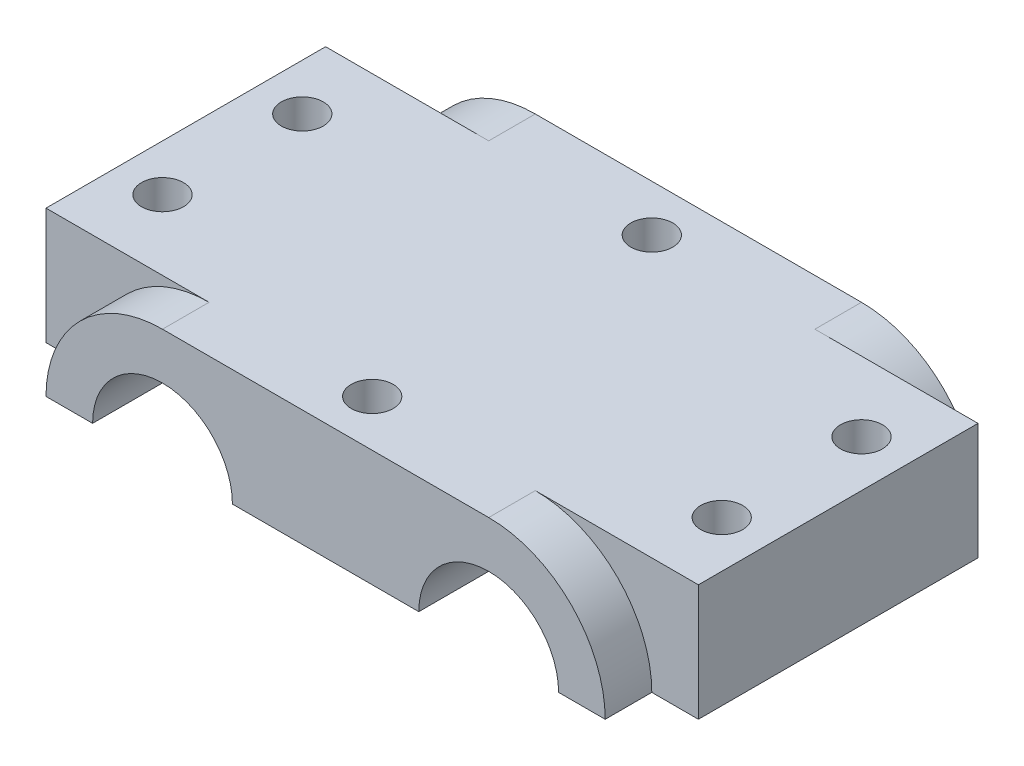
ISO-10303-21;
HEADER;
FILE_DESCRIPTION(('STEP AP214'),'2;1');
FILE_NAME('part.step','',(''),(''),'','','');
FILE_SCHEMA(('AUTOMOTIVE_DESIGN { 1 0 10303 214 1 1 1 1 }'));
ENDSEC;
DATA;
#1=APPLICATION_CONTEXT('core data for automotive mechanical design processes');
#2=APPLICATION_PROTOCOL_DEFINITION('international standard','automotive_design',2000,#1);
#3=PRODUCT_CONTEXT('',#1,'mechanical');
#4=PRODUCT('Part','Part','',(#3));
#5=PRODUCT_RELATED_PRODUCT_CATEGORY('part','',(#4));
#6=PRODUCT_DEFINITION_FORMATION('','',#4);
#7=PRODUCT_DEFINITION_CONTEXT('part definition',#1,'design');
#8=PRODUCT_DEFINITION('design','',#6,#7);
#9=PRODUCT_DEFINITION_SHAPE('','',#8);
#10=(LENGTH_UNIT() NAMED_UNIT(*) SI_UNIT(.MILLI.,.METRE.));
#11=(NAMED_UNIT(*) PLANE_ANGLE_UNIT() SI_UNIT($,.RADIAN.));
#12=(NAMED_UNIT(*) SI_UNIT($,.STERADIAN.) SOLID_ANGLE_UNIT());
#13=UNCERTAINTY_MEASURE_WITH_UNIT(LENGTH_MEASURE(1.E-05),#10,'distance_accuracy_value','');
#14=(GEOMETRIC_REPRESENTATION_CONTEXT(3) GLOBAL_UNCERTAINTY_ASSIGNED_CONTEXT((#13)) GLOBAL_UNIT_ASSIGNED_CONTEXT((#10,
#11,#12)) REPRESENTATION_CONTEXT('',''));
#15=CARTESIAN_POINT('',(0.,0.,0.));
#16=DIRECTION('',(0.,0.,1.));
#17=DIRECTION('',(1.,0.,0.));
#18=AXIS2_PLACEMENT_3D('',#15,#16,#17);
#19=CARTESIAN_POINT('',(70.,0.,40.));
#20=DIRECTION('',(-1.,0.,0.));
#21=DIRECTION('',(0.,0.,1.));
#22=AXIS2_PLACEMENT_3D('',#19,#20,#21);
#23=PLANE('',#22);
#24=DIRECTION('',(0.,1.,0.));
#25=VECTOR('',#24,1.);
#26=CARTESIAN_POINT('',(70.,0.,5.));
#27=LINE('',#26,#25);
#28=CARTESIAN_POINT('',(70.,0.,5.));
#29=VERTEX_POINT('',#28);
#30=CARTESIAN_POINT('',(70.,12.5,5.));
#31=VERTEX_POINT('',#30);
#32=EDGE_CURVE('E181',#29,#31,#27,.T.);
#33=ORIENTED_EDGE('',*,*,#32,.T.);
#34=DIRECTION('',(0.,0.,-1.));
#35=VECTOR('',#34,1.);
#36=CARTESIAN_POINT('',(70.,12.5,40.));
#37=LINE('',#36,#35);
#38=CARTESIAN_POINT('',(70.,12.5,35.));
#39=VERTEX_POINT('',#38);
#40=EDGE_CURVE('E255',#39,#31,#37,.T.);
#41=ORIENTED_EDGE('',*,*,#40,.F.);
#42=DIRECTION('',(0.,1.,0.));
#43=VECTOR('',#42,1.);
#44=CARTESIAN_POINT('',(70.,0.,35.));
#45=LINE('',#44,#43);
#46=CARTESIAN_POINT('',(70.,0.,35.));
#47=VERTEX_POINT('',#46);
#48=EDGE_CURVE('E215',#47,#39,#45,.T.);
#49=ORIENTED_EDGE('',*,*,#48,.F.);
#50=DIRECTION('',(0.,0.,-1.));
#51=VECTOR('',#50,1.);
#52=CARTESIAN_POINT('',(70.,0.,40.));
#53=LINE('',#52,#51);
#54=EDGE_CURVE('E258',#47,#29,#53,.T.);
#55=ORIENTED_EDGE('',*,*,#54,.T.);
#56=EDGE_LOOP('',(#33,#41,#49,#55));
#57=FACE_BOUND('',#56,.T.);
#58=ADVANCED_FACE('F37',(#57),#23,.F.);
#59=CARTESIAN_POINT('',(0.,12.5,40.));
#60=DIRECTION('',(0.,-1.,0.));
#61=DIRECTION('',(0.,0.,-1.));
#62=AXIS2_PLACEMENT_3D('',#59,#60,#61);
#63=PLANE('',#62);
#64=CARTESIAN_POINT('',(35.,12.5,5.));
#65=DIRECTION('',(0.,1.,0.));
#66=DIRECTION('',(0.,0.,1.));
#67=AXIS2_PLACEMENT_3D('',#64,#65,#66);
#68=CIRCLE('',#67,2.25);
#69=CARTESIAN_POINT('',(35.,12.5,7.25));
#70=VERTEX_POINT('',#69);
#71=EDGE_CURVE('E388',#70,#70,#68,.T.);
#72=ORIENTED_EDGE('',*,*,#71,.F.);
#73=EDGE_LOOP('',(#72));
#74=FACE_BOUND('',#73,.T.);
#75=CARTESIAN_POINT('',(65.,12.5,27.5));
#76=DIRECTION('',(0.,1.,0.));
#77=DIRECTION('',(0.,0.,1.));
#78=AXIS2_PLACEMENT_3D('',#75,#76,#77);
#79=CIRCLE('',#78,2.24999999999998);
#80=CARTESIAN_POINT('',(65.,12.5,29.75));
#81=VERTEX_POINT('',#80);
#82=EDGE_CURVE('E376',#81,#81,#79,.T.);
#83=ORIENTED_EDGE('',*,*,#82,.F.);
#84=EDGE_LOOP('',(#83));
#85=FACE_BOUND('',#84,.T.);
#86=CARTESIAN_POINT('',(35.,12.5,35.));
#87=DIRECTION('',(0.,1.,0.));
#88=DIRECTION('',(0.,0.,1.));
#89=AXIS2_PLACEMENT_3D('',#86,#87,#88);
#90=CIRCLE('',#89,2.25);
#91=CARTESIAN_POINT('',(35.,12.5,37.25));
#92=VERTEX_POINT('',#91);
#93=EDGE_CURVE('E384',#92,#92,#90,.T.);
#94=ORIENTED_EDGE('',*,*,#93,.F.);
#95=EDGE_LOOP('',(#94));
#96=FACE_BOUND('',#95,.T.);
#97=CARTESIAN_POINT('',(5.,12.5,12.5));
#98=DIRECTION('',(0.,1.,0.));
#99=DIRECTION('',(0.,0.,1.));
#100=AXIS2_PLACEMENT_3D('',#97,#98,#99);
#101=CIRCLE('',#100,2.25);
#102=CARTESIAN_POINT('',(5.,12.5,14.75));
#103=VERTEX_POINT('',#102);
#104=EDGE_CURVE('E385',#103,#103,#101,.T.);
#105=ORIENTED_EDGE('',*,*,#104,.F.);
#106=EDGE_LOOP('',(#105));
#107=FACE_BOUND('',#106,.T.);
#108=CARTESIAN_POINT('',(5.,12.5,27.5));
#109=DIRECTION('',(0.,1.,0.));
#110=DIRECTION('',(0.,0.,1.));
#111=AXIS2_PLACEMENT_3D('',#108,#109,#110);
#112=CIRCLE('',#111,2.25);
#113=CARTESIAN_POINT('',(5.,12.5,29.75));
#114=VERTEX_POINT('',#113);
#115=EDGE_CURVE('E367',#114,#114,#112,.T.);
#116=ORIENTED_EDGE('',*,*,#115,.F.);
#117=EDGE_LOOP('',(#116));
#118=FACE_BOUND('',#117,.T.);
#119=CARTESIAN_POINT('',(65.,12.5,12.5));
#120=DIRECTION('',(0.,1.,0.));
#121=DIRECTION('',(0.,0.,1.));
#122=AXIS2_PLACEMENT_3D('',#119,#120,#121);
#123=CIRCLE('',#122,2.24999999999998);
#124=CARTESIAN_POINT('',(65.,12.5,14.75));
#125=VERTEX_POINT('',#124);
#126=EDGE_CURVE('E368',#125,#125,#123,.T.);
#127=ORIENTED_EDGE('',*,*,#126,.F.);
#128=EDGE_LOOP('',(#127));
#129=FACE_BOUND('',#128,.T.);
#130=DIRECTION('',(0.,0.,-1.));
#131=VECTOR('',#130,1.);
#132=CARTESIAN_POINT('',(17.5,12.5,5.));
#133=LINE('',#132,#131);
#134=CARTESIAN_POINT('',(17.5,12.5,5.));
#135=VERTEX_POINT('',#134);
#136=CARTESIAN_POINT('',(17.5,12.5,0.));
#137=VERTEX_POINT('',#136);
#138=EDGE_CURVE('E60',#135,#137,#133,.T.);
#139=ORIENTED_EDGE('',*,*,#138,.F.);
#140=DIRECTION('',(-1.,0.,0.));
#141=VECTOR('',#140,1.);
#142=CARTESIAN_POINT('',(17.5,12.5,5.));
#143=LINE('',#142,#141);
#144=CARTESIAN_POINT('',(0.,12.5,5.));
#145=VERTEX_POINT('',#144);
#146=EDGE_CURVE('E156',#135,#145,#143,.T.);
#147=ORIENTED_EDGE('',*,*,#146,.T.);
#148=DIRECTION('',(0.,0.,-1.));
#149=VECTOR('',#148,1.);
#150=CARTESIAN_POINT('',(0.,12.5,40.));
#151=LINE('',#150,#149);
#152=CARTESIAN_POINT('',(0.,12.5,35.));
#153=VERTEX_POINT('',#152);
#154=EDGE_CURVE('E242',#153,#145,#151,.T.);
#155=ORIENTED_EDGE('',*,*,#154,.F.);
#156=DIRECTION('',(-1.,0.,0.));
#157=VECTOR('',#156,1.);
#158=CARTESIAN_POINT('',(17.5,12.5,35.));
#159=LINE('',#158,#157);
#160=CARTESIAN_POINT('',(17.5,12.5,35.));
#161=VERTEX_POINT('',#160);
#162=EDGE_CURVE('E195',#161,#153,#159,.T.);
#163=ORIENTED_EDGE('',*,*,#162,.F.);
#164=DIRECTION('',(0.,0.,1.));
#165=VECTOR('',#164,1.);
#166=CARTESIAN_POINT('',(17.5,12.5,35.));
#167=LINE('',#166,#165);
#168=CARTESIAN_POINT('',(17.5,12.5,40.));
#169=VERTEX_POINT('',#168);
#170=EDGE_CURVE('E208',#161,#169,#167,.T.);
#171=ORIENTED_EDGE('',*,*,#170,.T.);
#172=DIRECTION('',(-1.,0.,0.));
#173=VECTOR('',#172,1.);
#174=CARTESIAN_POINT('',(0.,12.5,40.));
#175=LINE('',#174,#173);
#176=CARTESIAN_POINT('',(52.5,12.5,40.));
#177=VERTEX_POINT('',#176);
#178=EDGE_CURVE('E239',#177,#169,#175,.T.);
#179=ORIENTED_EDGE('',*,*,#178,.F.);
#180=DIRECTION('',(0.,0.,1.));
#181=VECTOR('',#180,1.);
#182=CARTESIAN_POINT('',(52.5,12.5,35.));
#183=LINE('',#182,#181);
#184=CARTESIAN_POINT('',(52.5,12.5,35.));
#185=VERTEX_POINT('',#184);
#186=EDGE_CURVE('E213',#185,#177,#183,.T.);
#187=ORIENTED_EDGE('',*,*,#186,.F.);
#188=DIRECTION('',(-1.,0.,0.));
#189=VECTOR('',#188,1.);
#190=CARTESIAN_POINT('',(70.,12.5,35.));
#191=LINE('',#190,#189);
#192=EDGE_CURVE('E219',#39,#185,#191,.T.);
#193=ORIENTED_EDGE('',*,*,#192,.F.);
#194=ORIENTED_EDGE('',*,*,#40,.T.);
#195=DIRECTION('',(-1.,0.,0.));
#196=VECTOR('',#195,1.);
#197=CARTESIAN_POINT('',(70.,12.5,5.));
#198=LINE('',#197,#196);
#199=CARTESIAN_POINT('',(52.5,12.5,5.));
#200=VERTEX_POINT('',#199);
#201=EDGE_CURVE('E178',#31,#200,#198,.T.);
#202=ORIENTED_EDGE('',*,*,#201,.T.);
#203=DIRECTION('',(0.,0.,-1.));
#204=VECTOR('',#203,1.);
#205=CARTESIAN_POINT('',(52.5,12.5,5.));
#206=LINE('',#205,#204);
#207=CARTESIAN_POINT('',(52.5,12.5,0.));
#208=VERTEX_POINT('',#207);
#209=EDGE_CURVE('E192',#200,#208,#206,.T.);
#210=ORIENTED_EDGE('',*,*,#209,.T.);
#211=DIRECTION('',(-1.,0.,0.));
#212=VECTOR('',#211,1.);
#213=CARTESIAN_POINT('',(0.,12.5,0.));
#214=LINE('',#213,#212);
#215=EDGE_CURVE('E171',#208,#137,#214,.T.);
#216=ORIENTED_EDGE('',*,*,#215,.T.);
#217=EDGE_LOOP('',(#139,#147,#155,#163,#171,#179,#187,#193,#194,#202,#210,#216));
#218=FACE_BOUND('',#217,.T.);
#219=ADVANCED_FACE('F168',(#74,#85,#96,#107,#118,#129,#218),#63,.F.);
#220=CARTESIAN_POINT('',(0.,0.,40.));
#221=DIRECTION('',(0.,1.,0.));
#222=DIRECTION('',(0.,0.,1.));
#223=AXIS2_PLACEMENT_3D('',#220,#221,#222);
#224=PLANE('',#223);
#225=CARTESIAN_POINT('',(5.,0.,12.5));
#226=DIRECTION('',(0.,1.,0.));
#227=DIRECTION('',(0.,0.,1.));
#228=AXIS2_PLACEMENT_3D('',#225,#226,#227);
#229=CIRCLE('',#228,2.25);
#230=CARTESIAN_POINT('',(5.,0.,14.75));
#231=VERTEX_POINT('',#230);
#232=EDGE_CURVE('E362',#231,#231,#229,.F.);
#233=ORIENTED_EDGE('',*,*,#232,.F.);
#234=EDGE_LOOP('',(#233));
#235=FACE_BOUND('',#234,.T.);
#236=CARTESIAN_POINT('',(5.,0.,27.5));
#237=DIRECTION('',(0.,1.,0.));
#238=DIRECTION('',(0.,0.,1.));
#239=AXIS2_PLACEMENT_3D('',#236,#237,#238);
#240=CIRCLE('',#239,2.25);
#241=CARTESIAN_POINT('',(5.,0.,29.75));
#242=VERTEX_POINT('',#241);
#243=EDGE_CURVE('E365',#242,#242,#240,.F.);
#244=ORIENTED_EDGE('',*,*,#243,.F.);
#245=EDGE_LOOP('',(#244));
#246=FACE_BOUND('',#245,.T.);
#247=DIRECTION('',(0.,0.,-1.));
#248=VECTOR('',#247,1.);
#249=CARTESIAN_POINT('',(5.00000000000001,0.,5.));
#250=LINE('',#249,#248);
#251=CARTESIAN_POINT('',(5.00000000000001,0.,5.));
#252=VERTEX_POINT('',#251);
#253=CARTESIAN_POINT('',(5.00000000000001,0.,0.));
#254=VERTEX_POINT('',#253);
#255=EDGE_CURVE('E152',#252,#254,#250,.T.);
#256=ORIENTED_EDGE('',*,*,#255,.T.);
#257=DIRECTION('',(1.,0.,0.));
#258=VECTOR('',#257,1.);
#259=CARTESIAN_POINT('',(0.,0.,0.));
#260=LINE('',#259,#258);
#261=CARTESIAN_POINT('',(9.99999999999999,0.,0.));
#262=VERTEX_POINT('',#261);
#263=EDGE_CURVE('E211',#254,#262,#260,.T.);
#264=ORIENTED_EDGE('',*,*,#263,.T.);
#265=DIRECTION('',(0.,0.,-1.));
#266=VECTOR('',#265,1.);
#267=CARTESIAN_POINT('',(9.99999999999999,0.,40.));
#268=LINE('',#267,#266);
#269=CARTESIAN_POINT('',(9.99999999999999,0.,40.));
#270=VERTEX_POINT('',#269);
#271=EDGE_CURVE('E45',#270,#262,#268,.T.);
#272=ORIENTED_EDGE('',*,*,#271,.F.);
#273=DIRECTION('',(1.,0.,0.));
#274=VECTOR('',#273,1.);
#275=CARTESIAN_POINT('',(0.,0.,40.));
#276=LINE('',#275,#274);
#277=CARTESIAN_POINT('',(5.,0.,40.));
#278=VERTEX_POINT('',#277);
#279=EDGE_CURVE('E228',#278,#270,#276,.T.);
#280=ORIENTED_EDGE('',*,*,#279,.F.);
#281=DIRECTION('',(0.,0.,1.));
#282=VECTOR('',#281,1.);
#283=CARTESIAN_POINT('',(5.00000000000001,0.,35.));
#284=LINE('',#283,#282);
#285=CARTESIAN_POINT('',(5.00000000000001,0.,35.));
#286=VERTEX_POINT('',#285);
#287=EDGE_CURVE('E205',#286,#278,#284,.T.);
#288=ORIENTED_EDGE('',*,*,#287,.F.);
#289=DIRECTION('',(1.,0.,0.));
#290=VECTOR('',#289,1.);
#291=CARTESIAN_POINT('',(0.,0.,35.));
#292=LINE('',#291,#290);
#293=CARTESIAN_POINT('',(0.,0.,35.));
#294=VERTEX_POINT('',#293);
#295=EDGE_CURVE('E200',#294,#286,#292,.T.);
#296=ORIENTED_EDGE('',*,*,#295,.F.);
#297=DIRECTION('',(0.,0.,-1.));
#298=VECTOR('',#297,1.);
#299=CARTESIAN_POINT('',(0.,0.,40.));
#300=LINE('',#299,#298);
#301=CARTESIAN_POINT('',(0.,0.,5.));
#302=VERTEX_POINT('',#301);
#303=EDGE_CURVE('E11',#294,#302,#300,.T.);
#304=ORIENTED_EDGE('',*,*,#303,.T.);
#305=DIRECTION('',(1.,0.,0.));
#306=VECTOR('',#305,1.);
#307=CARTESIAN_POINT('',(0.,0.,5.));
#308=LINE('',#307,#306);
#309=EDGE_CURVE('E155',#302,#252,#308,.T.);
#310=ORIENTED_EDGE('',*,*,#309,.T.);
#311=EDGE_LOOP('',(#256,#264,#272,#280,#288,#296,#304,#310));
#312=FACE_BOUND('',#311,.T.);
#313=ADVANCED_FACE('F298',(#235,#246,#312),#224,.F.);
#314=CARTESIAN_POINT('',(60.,0.,40.));
#315=DIRECTION('',(0.,1.,0.));
#316=DIRECTION('',(0.,0.,1.));
#317=AXIS2_PLACEMENT_3D('',#314,#315,#316);
#318=PLANE('',#317);
#319=CARTESIAN_POINT('',(65.,0.,27.5));
#320=DIRECTION('',(0.,1.,0.));
#321=DIRECTION('',(0.,0.,1.));
#322=AXIS2_PLACEMENT_3D('',#319,#320,#321);
#323=CIRCLE('',#322,2.24999999999998);
#324=CARTESIAN_POINT('',(65.,0.,29.75));
#325=VERTEX_POINT('',#324);
#326=EDGE_CURVE('E637',#325,#325,#323,.F.);
#327=ORIENTED_EDGE('',*,*,#326,.F.);
#328=EDGE_LOOP('',(#327));
#329=FACE_BOUND('',#328,.T.);
#330=CARTESIAN_POINT('',(65.,0.,12.5));
#331=DIRECTION('',(0.,1.,0.));
#332=DIRECTION('',(0.,0.,1.));
#333=AXIS2_PLACEMENT_3D('',#330,#331,#332);
#334=CIRCLE('',#333,2.24999999999998);
#335=CARTESIAN_POINT('',(65.,0.,14.75));
#336=VERTEX_POINT('',#335);
#337=EDGE_CURVE('E373',#336,#336,#334,.F.);
#338=ORIENTED_EDGE('',*,*,#337,.F.);
#339=EDGE_LOOP('',(#338));
#340=FACE_BOUND('',#339,.T.);
#341=DIRECTION('',(0.,0.,-1.));
#342=VECTOR('',#341,1.);
#343=CARTESIAN_POINT('',(65.,0.,5.));
#344=LINE('',#343,#342);
#345=CARTESIAN_POINT('',(65.,0.,5.));
#346=VERTEX_POINT('',#345);
#347=CARTESIAN_POINT('',(65.,0.,0.));
#348=VERTEX_POINT('',#347);
#349=EDGE_CURVE('E52',#346,#348,#344,.T.);
#350=ORIENTED_EDGE('',*,*,#349,.F.);
#351=DIRECTION('',(1.,0.,0.));
#352=VECTOR('',#351,1.);
#353=CARTESIAN_POINT('',(65.,0.,5.));
#354=LINE('',#353,#352);
#355=EDGE_CURVE('E185',#346,#29,#354,.T.);
#356=ORIENTED_EDGE('',*,*,#355,.T.);
#357=ORIENTED_EDGE('',*,*,#54,.F.);
#358=DIRECTION('',(1.,0.,0.));
#359=VECTOR('',#358,1.);
#360=CARTESIAN_POINT('',(65.,0.,35.));
#361=LINE('',#360,#359);
#362=CARTESIAN_POINT('',(65.,0.,35.));
#363=VERTEX_POINT('',#362);
#364=EDGE_CURVE('E221',#363,#47,#361,.T.);
#365=ORIENTED_EDGE('',*,*,#364,.F.);
#366=DIRECTION('',(0.,0.,1.));
#367=VECTOR('',#366,1.);
#368=CARTESIAN_POINT('',(65.,0.,35.));
#369=LINE('',#368,#367);
#370=CARTESIAN_POINT('',(65.,0.,40.));
#371=VERTEX_POINT('',#370);
#372=EDGE_CURVE('E173',#363,#371,#369,.T.);
#373=ORIENTED_EDGE('',*,*,#372,.T.);
#374=DIRECTION('',(1.,0.,0.));
#375=VECTOR('',#374,1.);
#376=CARTESIAN_POINT('',(60.,0.,40.));
#377=LINE('',#376,#375);
#378=CARTESIAN_POINT('',(60.,0.,40.));
#379=VERTEX_POINT('',#378);
#380=EDGE_CURVE('E236',#379,#371,#377,.T.);
#381=ORIENTED_EDGE('',*,*,#380,.F.);
#382=DIRECTION('',(0.,0.,-1.));
#383=VECTOR('',#382,1.);
#384=CARTESIAN_POINT('',(60.,0.,40.));
#385=LINE('',#384,#383);
#386=CARTESIAN_POINT('',(60.,0.,0.));
#387=VERTEX_POINT('',#386);
#388=EDGE_CURVE('E261',#379,#387,#385,.T.);
#389=ORIENTED_EDGE('',*,*,#388,.T.);
#390=DIRECTION('',(1.,0.,0.));
#391=VECTOR('',#390,1.);
#392=CARTESIAN_POINT('',(60.,0.,0.));
#393=LINE('',#392,#391);
#394=EDGE_CURVE('E250',#387,#348,#393,.T.);
#395=ORIENTED_EDGE('',*,*,#394,.T.);
#396=EDGE_LOOP('',(#350,#356,#357,#365,#373,#381,#389,#395));
#397=FACE_BOUND('',#396,.T.);
#398=ADVANCED_FACE('F313',(#329,#340,#397),#318,.F.);
#399=CARTESIAN_POINT('',(52.5,0.,0.));
#400=DIRECTION('',(0.,0.,1.));
#401=DIRECTION('',(1.,0.,0.));
#402=AXIS2_PLACEMENT_3D('',#399,#400,#401);
#403=PLANE('',#402);
#404=CARTESIAN_POINT('',(17.5,0.,0.));
#405=DIRECTION('',(0.,0.,-1.));
#406=DIRECTION('',(-1.,0.,0.));
#407=AXIS2_PLACEMENT_3D('',#404,#405,#406);
#408=CIRCLE('',#407,12.5);
#409=EDGE_CURVE('E165',#254,#137,#408,.T.);
#410=ORIENTED_EDGE('',*,*,#409,.T.);
#411=ORIENTED_EDGE('',*,*,#215,.F.);
#412=CARTESIAN_POINT('',(52.5,0.,0.));
#413=DIRECTION('',(0.,0.,-1.));
#414=DIRECTION('',(1.,0.,0.));
#415=AXIS2_PLACEMENT_3D('',#412,#413,#414);
#416=CIRCLE('',#415,12.5);
#417=EDGE_CURVE('E182',#208,#348,#416,.T.);
#418=ORIENTED_EDGE('',*,*,#417,.T.);
#419=ORIENTED_EDGE('',*,*,#394,.F.);
#420=CARTESIAN_POINT('',(52.5,0.,0.));
#421=DIRECTION('',(0.,0.,-1.));
#422=DIRECTION('',(1.,0.,0.));
#423=AXIS2_PLACEMENT_3D('',#420,#421,#422);
#424=CIRCLE('',#423,7.5);
#425=CARTESIAN_POINT('',(45.,0.,0.));
#426=VERTEX_POINT('',#425);
#427=EDGE_CURVE('E248',#426,#387,#424,.T.);
#428=ORIENTED_EDGE('',*,*,#427,.F.);
#429=DIRECTION('',(1.,0.,0.));
#430=VECTOR('',#429,1.);
#431=CARTESIAN_POINT('',(25.,0.,0.));
#432=LINE('',#431,#430);
#433=CARTESIAN_POINT('',(25.,0.,0.));
#434=VERTEX_POINT('',#433);
#435=EDGE_CURVE('E246',#434,#426,#432,.T.);
#436=ORIENTED_EDGE('',*,*,#435,.F.);
#437=CARTESIAN_POINT('',(17.5,0.,0.));
#438=DIRECTION('',(0.,0.,-1.));
#439=DIRECTION('',(1.,0.,0.));
#440=AXIS2_PLACEMENT_3D('',#437,#438,#439);
#441=CIRCLE('',#440,7.5);
#442=EDGE_CURVE('E244',#262,#434,#441,.T.);
#443=ORIENTED_EDGE('',*,*,#442,.F.);
#444=ORIENTED_EDGE('',*,*,#263,.F.);
#445=EDGE_LOOP('',(#410,#411,#418,#419,#428,#436,#443,#444));
#446=FACE_BOUND('',#445,.T.);
#447=ADVANCED_FACE('F281',(#446),#403,.F.);
#448=CARTESIAN_POINT('',(52.5,0.,40.));
#449=DIRECTION('',(0.,0.,1.));
#450=DIRECTION('',(1.,0.,0.));
#451=AXIS2_PLACEMENT_3D('',#448,#449,#450);
#452=PLANE('',#451);
#453=CARTESIAN_POINT('',(17.5,0.,40.));
#454=DIRECTION('',(0.,0.,-1.));
#455=DIRECTION('',(-1.,0.,0.));
#456=AXIS2_PLACEMENT_3D('',#453,#454,#455);
#457=CIRCLE('',#456,12.5);
#458=EDGE_CURVE('E198',#278,#169,#457,.T.);
#459=ORIENTED_EDGE('',*,*,#458,.F.);
#460=ORIENTED_EDGE('',*,*,#279,.T.);
#461=CARTESIAN_POINT('',(17.5,0.,40.));
#462=DIRECTION('',(0.,0.,-1.));
#463=DIRECTION('',(1.,0.,0.));
#464=AXIS2_PLACEMENT_3D('',#461,#462,#463);
#465=CIRCLE('',#464,7.5);
#466=CARTESIAN_POINT('',(25.,0.,40.));
#467=VERTEX_POINT('',#466);
#468=EDGE_CURVE('E230',#270,#467,#465,.T.);
#469=ORIENTED_EDGE('',*,*,#468,.T.);
#470=DIRECTION('',(1.,0.,0.));
#471=VECTOR('',#470,1.);
#472=CARTESIAN_POINT('',(25.,0.,40.));
#473=LINE('',#472,#471);
#474=CARTESIAN_POINT('',(45.,0.,40.));
#475=VERTEX_POINT('',#474);
#476=EDGE_CURVE('E232',#467,#475,#473,.T.);
#477=ORIENTED_EDGE('',*,*,#476,.T.);
#478=CARTESIAN_POINT('',(52.5,0.,40.));
#479=DIRECTION('',(0.,0.,-1.));
#480=DIRECTION('',(1.,0.,0.));
#481=AXIS2_PLACEMENT_3D('',#478,#479,#480);
#482=CIRCLE('',#481,7.5);
#483=EDGE_CURVE('E234',#475,#379,#482,.T.);
#484=ORIENTED_EDGE('',*,*,#483,.T.);
#485=ORIENTED_EDGE('',*,*,#380,.T.);
#486=CARTESIAN_POINT('',(52.5,0.,40.));
#487=DIRECTION('',(0.,0.,-1.));
#488=DIRECTION('',(1.,0.,0.));
#489=AXIS2_PLACEMENT_3D('',#486,#487,#488);
#490=CIRCLE('',#489,12.5);
#491=EDGE_CURVE('E207',#177,#371,#490,.T.);
#492=ORIENTED_EDGE('',*,*,#491,.F.);
#493=ORIENTED_EDGE('',*,*,#178,.T.);
#494=EDGE_LOOP('',(#459,#460,#469,#477,#484,#485,#492,#493));
#495=FACE_BOUND('',#494,.T.);
#496=ADVANCED_FACE('F295',(#495),#452,.T.);
#497=CARTESIAN_POINT('',(0.,0.,40.));
#498=DIRECTION('',(1.,0.,0.));
#499=DIRECTION('',(0.,0.,-1.));
#500=AXIS2_PLACEMENT_3D('',#497,#498,#499);
#501=PLANE('',#500);
#502=ORIENTED_EDGE('',*,*,#154,.T.);
#503=DIRECTION('',(0.,-1.,0.));
#504=VECTOR('',#503,1.);
#505=CARTESIAN_POINT('',(0.,12.5,5.));
#506=LINE('',#505,#504);
#507=EDGE_CURVE('E161',#145,#302,#506,.T.);
#508=ORIENTED_EDGE('',*,*,#507,.T.);
#509=ORIENTED_EDGE('',*,*,#303,.F.);
#510=DIRECTION('',(0.,-1.,0.));
#511=VECTOR('',#510,1.);
#512=CARTESIAN_POINT('',(0.,12.5,35.));
#513=LINE('',#512,#511);
#514=EDGE_CURVE('E197',#153,#294,#513,.T.);
#515=ORIENTED_EDGE('',*,*,#514,.F.);
#516=EDGE_LOOP('',(#502,#508,#509,#515));
#517=FACE_BOUND('',#516,.T.);
#518=ADVANCED_FACE('F39',(#517),#501,.F.);
#519=CARTESIAN_POINT('',(17.5,0.,40.));
#520=DIRECTION('',(0.,0.,-1.));
#521=DIRECTION('',(-1.,0.,0.));
#522=AXIS2_PLACEMENT_3D('',#519,#520,#521);
#523=CYLINDRICAL_SURFACE('',#522,7.5);
#524=ORIENTED_EDGE('',*,*,#442,.T.);
#525=DIRECTION('',(0.,0.,-1.));
#526=VECTOR('',#525,1.);
#527=CARTESIAN_POINT('',(25.,0.,40.));
#528=LINE('',#527,#526);
#529=EDGE_CURVE('E267',#467,#434,#528,.T.);
#530=ORIENTED_EDGE('',*,*,#529,.F.);
#531=ORIENTED_EDGE('',*,*,#468,.F.);
#532=ORIENTED_EDGE('',*,*,#271,.T.);
#533=EDGE_LOOP('',(#524,#530,#531,#532));
#534=FACE_BOUND('',#533,.T.);
#535=ADVANCED_FACE('F274',(#534),#523,.F.);
#536=CARTESIAN_POINT('',(25.,0.,40.));
#537=DIRECTION('',(0.,1.,0.));
#538=DIRECTION('',(0.,0.,1.));
#539=AXIS2_PLACEMENT_3D('',#536,#537,#538);
#540=PLANE('',#539);
#541=CARTESIAN_POINT('',(35.,0.,5.));
#542=DIRECTION('',(0.,1.,0.));
#543=DIRECTION('',(0.,0.,1.));
#544=AXIS2_PLACEMENT_3D('',#541,#542,#543);
#545=CIRCLE('',#544,2.25);
#546=CARTESIAN_POINT('',(35.,0.,7.25));
#547=VERTEX_POINT('',#546);
#548=EDGE_CURVE('E191',#547,#547,#545,.F.);
#549=ORIENTED_EDGE('',*,*,#548,.F.);
#550=EDGE_LOOP('',(#549));
#551=FACE_BOUND('',#550,.T.);
#552=CARTESIAN_POINT('',(35.,0.,35.));
#553=DIRECTION('',(0.,1.,0.));
#554=DIRECTION('',(0.,0.,1.));
#555=AXIS2_PLACEMENT_3D('',#552,#553,#554);
#556=CIRCLE('',#555,2.25);
#557=CARTESIAN_POINT('',(35.,0.,37.25));
#558=VERTEX_POINT('',#557);
#559=EDGE_CURVE('E381',#558,#558,#556,.F.);
#560=ORIENTED_EDGE('',*,*,#559,.F.);
#561=EDGE_LOOP('',(#560));
#562=FACE_BOUND('',#561,.T.);
#563=ORIENTED_EDGE('',*,*,#435,.T.);
#564=DIRECTION('',(0.,0.,-1.));
#565=VECTOR('',#564,1.);
#566=CARTESIAN_POINT('',(45.,0.,40.));
#567=LINE('',#566,#565);
#568=EDGE_CURVE('E264',#475,#426,#567,.T.);
#569=ORIENTED_EDGE('',*,*,#568,.F.);
#570=ORIENTED_EDGE('',*,*,#476,.F.);
#571=ORIENTED_EDGE('',*,*,#529,.T.);
#572=EDGE_LOOP('',(#563,#569,#570,#571));
#573=FACE_BOUND('',#572,.T.);
#574=ADVANCED_FACE('F286',(#551,#562,#573),#540,.F.);
#575=CARTESIAN_POINT('',(52.5,0.,40.));
#576=DIRECTION('',(0.,0.,-1.));
#577=DIRECTION('',(-1.,0.,0.));
#578=AXIS2_PLACEMENT_3D('',#575,#576,#577);
#579=CYLINDRICAL_SURFACE('',#578,7.5);
#580=ORIENTED_EDGE('',*,*,#427,.T.);
#581=ORIENTED_EDGE('',*,*,#388,.F.);
#582=ORIENTED_EDGE('',*,*,#483,.F.);
#583=ORIENTED_EDGE('',*,*,#568,.T.);
#584=EDGE_LOOP('',(#580,#581,#582,#583));
#585=FACE_BOUND('',#584,.T.);
#586=ADVANCED_FACE('F290',(#585),#579,.F.);
#587=CARTESIAN_POINT('',(52.5,0.,35.));
#588=DIRECTION('',(0.,0.,1.));
#589=DIRECTION('',(1.,0.,0.));
#590=AXIS2_PLACEMENT_3D('',#587,#588,#589);
#591=CYLINDRICAL_SURFACE('',#590,12.5);
#592=ORIENTED_EDGE('',*,*,#491,.T.);
#593=ORIENTED_EDGE('',*,*,#372,.F.);
#594=CARTESIAN_POINT('',(52.5,0.,35.));
#595=DIRECTION('',(0.,0.,-1.));
#596=DIRECTION('',(1.,0.,0.));
#597=AXIS2_PLACEMENT_3D('',#594,#595,#596);
#598=CIRCLE('',#597,12.5);
#599=EDGE_CURVE('E223',#185,#363,#598,.T.);
#600=ORIENTED_EDGE('',*,*,#599,.F.);
#601=ORIENTED_EDGE('',*,*,#186,.T.);
#602=EDGE_LOOP('',(#592,#593,#600,#601));
#603=FACE_BOUND('',#602,.T.);
#604=ADVANCED_FACE('F317',(#603),#591,.T.);
#605=CARTESIAN_POINT('',(52.5,0.,35.));
#606=DIRECTION('',(0.,0.,1.));
#607=DIRECTION('',(1.,0.,0.));
#608=AXIS2_PLACEMENT_3D('',#605,#606,#607);
#609=PLANE('',#608);
#610=ORIENTED_EDGE('',*,*,#192,.T.);
#611=ORIENTED_EDGE('',*,*,#599,.T.);
#612=ORIENTED_EDGE('',*,*,#364,.T.);
#613=ORIENTED_EDGE('',*,*,#48,.T.);
#614=EDGE_LOOP('',(#610,#611,#612,#613));
#615=FACE_BOUND('',#614,.T.);
#616=ADVANCED_FACE('F319',(#615),#609,.T.);
#617=CARTESIAN_POINT('',(17.5,0.,35.));
#618=DIRECTION('',(0.,0.,1.));
#619=DIRECTION('',(1.,0.,0.));
#620=AXIS2_PLACEMENT_3D('',#617,#618,#619);
#621=CYLINDRICAL_SURFACE('',#620,12.5);
#622=ORIENTED_EDGE('',*,*,#458,.T.);
#623=ORIENTED_EDGE('',*,*,#170,.F.);
#624=CARTESIAN_POINT('',(17.5,0.,35.));
#625=DIRECTION('',(0.,0.,-1.));
#626=DIRECTION('',(-1.,0.,0.));
#627=AXIS2_PLACEMENT_3D('',#624,#625,#626);
#628=CIRCLE('',#627,12.5);
#629=EDGE_CURVE('E202',#286,#161,#628,.T.);
#630=ORIENTED_EDGE('',*,*,#629,.F.);
#631=ORIENTED_EDGE('',*,*,#287,.T.);
#632=EDGE_LOOP('',(#622,#623,#630,#631));
#633=FACE_BOUND('',#632,.T.);
#634=ADVANCED_FACE('F303',(#633),#621,.T.);
#635=CARTESIAN_POINT('',(17.5,0.,35.));
#636=DIRECTION('',(0.,0.,-1.));
#637=DIRECTION('',(-1.,0.,0.));
#638=AXIS2_PLACEMENT_3D('',#635,#636,#637);
#639=PLANE('',#638);
#640=ORIENTED_EDGE('',*,*,#162,.T.);
#641=ORIENTED_EDGE('',*,*,#514,.T.);
#642=ORIENTED_EDGE('',*,*,#295,.T.);
#643=ORIENTED_EDGE('',*,*,#629,.T.);
#644=EDGE_LOOP('',(#640,#641,#642,#643));
#645=FACE_BOUND('',#644,.T.);
#646=ADVANCED_FACE('F306',(#645),#639,.F.);
#647=CARTESIAN_POINT('',(52.5,0.,5.));
#648=DIRECTION('',(0.,0.,-1.));
#649=DIRECTION('',(-1.,0.,0.));
#650=AXIS2_PLACEMENT_3D('',#647,#648,#649);
#651=CYLINDRICAL_SURFACE('',#650,12.5);
#652=ORIENTED_EDGE('',*,*,#417,.F.);
#653=ORIENTED_EDGE('',*,*,#209,.F.);
#654=CARTESIAN_POINT('',(52.5,0.,5.));
#655=DIRECTION('',(0.,0.,-1.));
#656=DIRECTION('',(1.,0.,0.));
#657=AXIS2_PLACEMENT_3D('',#654,#655,#656);
#658=CIRCLE('',#657,12.5);
#659=EDGE_CURVE('E188',#200,#346,#658,.T.);
#660=ORIENTED_EDGE('',*,*,#659,.T.);
#661=ORIENTED_EDGE('',*,*,#349,.T.);
#662=EDGE_LOOP('',(#652,#653,#660,#661));
#663=FACE_BOUND('',#662,.T.);
#664=ADVANCED_FACE('F328',(#663),#651,.T.);
#665=CARTESIAN_POINT('',(52.5,0.,5.));
#666=DIRECTION('',(0.,0.,-1.));
#667=DIRECTION('',(1.,0.,0.));
#668=AXIS2_PLACEMENT_3D('',#665,#666,#667);
#669=PLANE('',#668);
#670=ORIENTED_EDGE('',*,*,#201,.F.);
#671=ORIENTED_EDGE('',*,*,#32,.F.);
#672=ORIENTED_EDGE('',*,*,#355,.F.);
#673=ORIENTED_EDGE('',*,*,#659,.F.);
#674=EDGE_LOOP('',(#670,#671,#672,#673));
#675=FACE_BOUND('',#674,.T.);
#676=ADVANCED_FACE('F327',(#675),#669,.T.);
#677=CARTESIAN_POINT('',(17.5,0.,5.));
#678=DIRECTION('',(0.,0.,-1.));
#679=DIRECTION('',(-1.,0.,0.));
#680=AXIS2_PLACEMENT_3D('',#677,#678,#679);
#681=CYLINDRICAL_SURFACE('',#680,12.5);
#682=ORIENTED_EDGE('',*,*,#409,.F.);
#683=ORIENTED_EDGE('',*,*,#255,.F.);
#684=CARTESIAN_POINT('',(17.5,0.,5.));
#685=DIRECTION('',(0.,0.,-1.));
#686=DIRECTION('',(-1.,0.,0.));
#687=AXIS2_PLACEMENT_3D('',#684,#685,#686);
#688=CIRCLE('',#687,12.5);
#689=EDGE_CURVE('E148',#252,#135,#688,.T.);
#690=ORIENTED_EDGE('',*,*,#689,.T.);
#691=ORIENTED_EDGE('',*,*,#138,.T.);
#692=EDGE_LOOP('',(#682,#683,#690,#691));
#693=FACE_BOUND('',#692,.T.);
#694=ADVANCED_FACE('F150',(#693),#681,.T.);
#695=CARTESIAN_POINT('',(17.5,0.,5.));
#696=DIRECTION('',(0.,0.,1.));
#697=DIRECTION('',(-1.,0.,0.));
#698=AXIS2_PLACEMENT_3D('',#695,#696,#697);
#699=PLANE('',#698);
#700=ORIENTED_EDGE('',*,*,#146,.F.);
#701=ORIENTED_EDGE('',*,*,#689,.F.);
#702=ORIENTED_EDGE('',*,*,#309,.F.);
#703=ORIENTED_EDGE('',*,*,#507,.F.);
#704=EDGE_LOOP('',(#700,#701,#702,#703));
#705=FACE_BOUND('',#704,.T.);
#706=ADVANCED_FACE('F159',(#705),#699,.F.);
#707=CARTESIAN_POINT('',(35.,-0.00100000000000273,35.));
#708=DIRECTION('',(0.,1.,0.));
#709=DIRECTION('',(0.,0.,1.));
#710=AXIS2_PLACEMENT_3D('',#707,#708,#709);
#711=CYLINDRICAL_SURFACE('',#710,2.25);
#712=ORIENTED_EDGE('',*,*,#93,.T.);
#713=EDGE_LOOP('',(#712));
#714=FACE_BOUND('',#713,.T.);
#715=ORIENTED_EDGE('',*,*,#559,.T.);
#716=EDGE_LOOP('',(#715));
#717=FACE_BOUND('',#716,.T.);
#718=ADVANCED_FACE('F416',(#714,#717),#711,.F.);
#719=CARTESIAN_POINT('',(35.,-0.00100000000000273,5.));
#720=DIRECTION('',(0.,1.,0.));
#721=DIRECTION('',(0.,0.,1.));
#722=AXIS2_PLACEMENT_3D('',#719,#720,#721);
#723=CYLINDRICAL_SURFACE('',#722,2.25);
#724=ORIENTED_EDGE('',*,*,#71,.T.);
#725=EDGE_LOOP('',(#724));
#726=FACE_BOUND('',#725,.T.);
#727=ORIENTED_EDGE('',*,*,#548,.T.);
#728=EDGE_LOOP('',(#727));
#729=FACE_BOUND('',#728,.T.);
#730=ADVANCED_FACE('F405',(#726,#729),#723,.F.);
#731=CARTESIAN_POINT('',(65.,-0.00100000000000273,12.5));
#732=DIRECTION('',(0.,1.,0.));
#733=DIRECTION('',(0.,0.,1.));
#734=AXIS2_PLACEMENT_3D('',#731,#732,#733);
#735=CYLINDRICAL_SURFACE('',#734,2.24999999999998);
#736=ORIENTED_EDGE('',*,*,#126,.T.);
#737=EDGE_LOOP('',(#736));
#738=FACE_BOUND('',#737,.T.);
#739=ORIENTED_EDGE('',*,*,#337,.T.);
#740=EDGE_LOOP('',(#739));
#741=FACE_BOUND('',#740,.T.);
#742=ADVANCED_FACE('F401',(#738,#741),#735,.F.);
#743=CARTESIAN_POINT('',(65.,-0.00100000000000273,27.5));
#744=DIRECTION('',(0.,1.,0.));
#745=DIRECTION('',(0.,0.,1.));
#746=AXIS2_PLACEMENT_3D('',#743,#744,#745);
#747=CYLINDRICAL_SURFACE('',#746,2.24999999999998);
#748=ORIENTED_EDGE('',*,*,#82,.T.);
#749=EDGE_LOOP('',(#748));
#750=FACE_BOUND('',#749,.T.);
#751=ORIENTED_EDGE('',*,*,#326,.T.);
#752=EDGE_LOOP('',(#751));
#753=FACE_BOUND('',#752,.T.);
#754=ADVANCED_FACE('F404',(#750,#753),#747,.F.);
#755=CARTESIAN_POINT('',(5.,-0.00100000000000273,27.5));
#756=DIRECTION('',(0.,1.,0.));
#757=DIRECTION('',(0.,0.,1.));
#758=AXIS2_PLACEMENT_3D('',#755,#756,#757);
#759=CYLINDRICAL_SURFACE('',#758,2.25);
#760=ORIENTED_EDGE('',*,*,#115,.T.);
#761=EDGE_LOOP('',(#760));
#762=FACE_BOUND('',#761,.T.);
#763=ORIENTED_EDGE('',*,*,#243,.T.);
#764=EDGE_LOOP('',(#763));
#765=FACE_BOUND('',#764,.T.);
#766=ADVANCED_FACE('F413',(#762,#765),#759,.F.);
#767=CARTESIAN_POINT('',(5.,-0.00100000000000273,12.5));
#768=DIRECTION('',(0.,1.,0.));
#769=DIRECTION('',(0.,0.,1.));
#770=AXIS2_PLACEMENT_3D('',#767,#768,#769);
#771=CYLINDRICAL_SURFACE('',#770,2.25);
#772=ORIENTED_EDGE('',*,*,#104,.T.);
#773=EDGE_LOOP('',(#772));
#774=FACE_BOUND('',#773,.T.);
#775=ORIENTED_EDGE('',*,*,#232,.T.);
#776=EDGE_LOOP('',(#775));
#777=FACE_BOUND('',#776,.T.);
#778=ADVANCED_FACE('F393',(#774,#777),#771,.F.);
#779=CLOSED_SHELL('',(#58,#219,#313,#398,#447,#496,#518,#535,#574,#586,#604,#616,#634,#646,#664,
#676,#694,#706,#718,#730,#742,#754,#766,#778));
#780=MANIFOLD_SOLID_BREP('B2',#779);
#781=ADVANCED_BREP_SHAPE_REPRESENTATION('',(#18,#780),#14);
#782=SHAPE_DEFINITION_REPRESENTATION(#9,#781);
ENDSEC;
END-ISO-10303-21;
